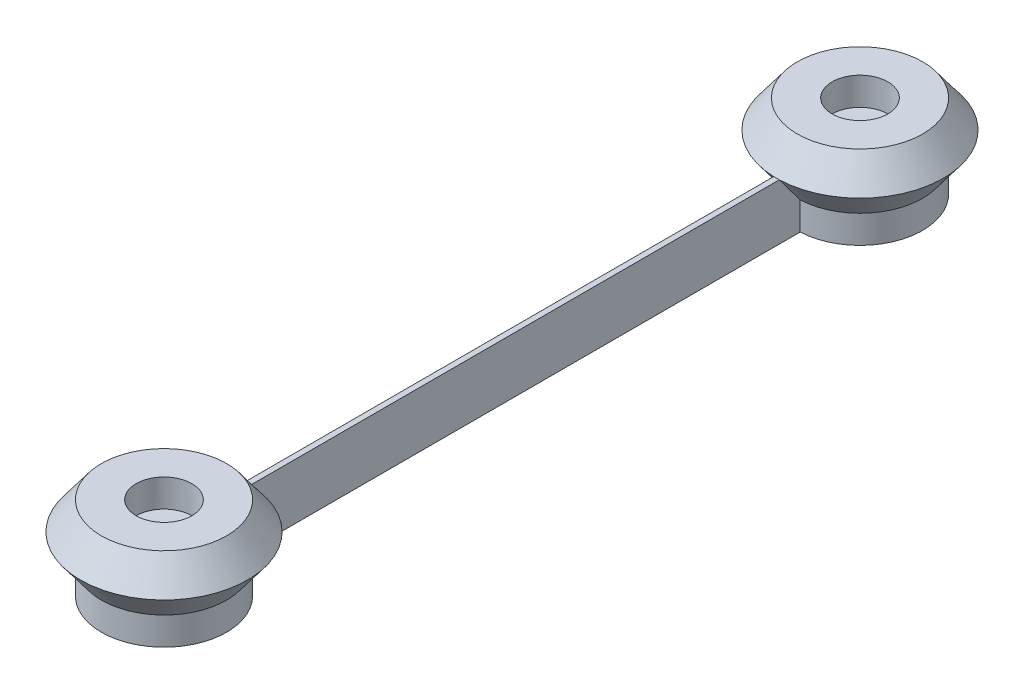
ISO-10303-21;
HEADER;
FILE_DESCRIPTION(('STEP AP214'),'2;1');
FILE_NAME('part.step','',(''),(''),'','','');
FILE_SCHEMA(('AUTOMOTIVE_DESIGN { 1 0 10303 214 1 1 1 1 }'));
ENDSEC;
DATA;
#1=APPLICATION_CONTEXT('core data for automotive mechanical design processes');
#2=APPLICATION_PROTOCOL_DEFINITION('international standard','automotive_design',2000,#1);
#3=PRODUCT_CONTEXT('',#1,'mechanical');
#4=PRODUCT('Part','Part','',(#3));
#5=PRODUCT_RELATED_PRODUCT_CATEGORY('part','',(#4));
#6=PRODUCT_DEFINITION_FORMATION('','',#4);
#7=PRODUCT_DEFINITION_CONTEXT('part definition',#1,'design');
#8=PRODUCT_DEFINITION('design','',#6,#7);
#9=PRODUCT_DEFINITION_SHAPE('','',#8);
#10=(LENGTH_UNIT() NAMED_UNIT(*) SI_UNIT(.MILLI.,.METRE.));
#11=(NAMED_UNIT(*) PLANE_ANGLE_UNIT() SI_UNIT($,.RADIAN.));
#12=(NAMED_UNIT(*) SI_UNIT($,.STERADIAN.) SOLID_ANGLE_UNIT());
#13=UNCERTAINTY_MEASURE_WITH_UNIT(LENGTH_MEASURE(1.E-05),#10,'distance_accuracy_value','');
#14=(GEOMETRIC_REPRESENTATION_CONTEXT(3) GLOBAL_UNCERTAINTY_ASSIGNED_CONTEXT((#13)) GLOBAL_UNIT_ASSIGNED_CONTEXT((#10,
#11,#12)) REPRESENTATION_CONTEXT('',''));
#15=CARTESIAN_POINT('',(0.,0.,0.));
#16=DIRECTION('',(0.,0.,1.));
#17=DIRECTION('',(1.,0.,0.));
#18=AXIS2_PLACEMENT_3D('',#15,#16,#17);
#19=CARTESIAN_POINT('',(0.400000000000017,8.,-4.00000000000001));
#20=DIRECTION('',(-1.,0.,0.));
#21=DIRECTION('',(0.,0.,1.));
#22=AXIS2_PLACEMENT_3D('',#19,#20,#21);
#23=PLANE('',#22);
#24=CARTESIAN_POINT('',(0.400000000000017,16.9444719099991,-81.29592272087));
#25=CARTESIAN_POINT('',(0.400000000000017,15.385579355443,-82.4653845755898));
#26=CARTESIAN_POINT('',(0.400000000000017,13.8266894406038,-83.6348499751761));
#27=CARTESIAN_POINT('',(0.400000000000017,10.7090037802558,-85.9739076348394));
#28=CARTESIAN_POINT('',(0.400000000000017,9.1502080347864,-87.1434998949687));
#29=CARTESIAN_POINT('',(0.400000000000017,6.81215641798637,-88.8980697267632));
#30=CARTESIAN_POINT('',(0.400000000000017,6.03283141406787,-89.4829551752583));
#31=CARTESIAN_POINT('',(0.400000000000017,4.47425913313125,-90.6528297579802));
#32=CARTESIAN_POINT('',(0.400000000000017,3.69501185611873,-91.2378188922144));
#33=CARTESIAN_POINT('',(0.400000000000017,2.13665772951559,-92.4079840697766));
#34=CARTESIAN_POINT('',(0.400000000000017,1.35755087991822,-92.9931601130956));
#35=CARTESIAN_POINT('',(0.400000000000017,-0.20039662916781,-94.1638664241077));
#36=CARTESIAN_POINT('',(0.400000000000017,-0.979237288697372,-94.7493966917463));
#37=CARTESIAN_POINT('',(0.400000000000017,-2.02365103499291,-95.5355919106607));
#38=CARTESIAN_POINT('',(0.400000000000017,-2.28954305826708,-95.7358330865061));
#39=CARTESIAN_POINT('',(0.400000000000017,-2.82119172556733,-96.1364947662393));
#40=CARTESIAN_POINT('',(0.400000000000017,-3.08694836967379,-96.3369152700204));
#41=CARTESIAN_POINT('',(0.400000000000017,-3.61824910011192,-96.738038761353));
#42=CARTESIAN_POINT('',(0.400000000000017,-3.88379318614195,-96.9387417493042));
#43=CARTESIAN_POINT('',(0.400000000000017,-4.28182573719319,-97.240171301074));
#44=CARTESIAN_POINT('',(0.400000000000017,-4.41445610822129,-97.3407104189299));
#45=CARTESIAN_POINT('',(0.400000000000017,-4.67957862864727,-97.5419709109763));
#46=CARTESIAN_POINT('',(0.400000000000017,-4.81207077794323,-97.6426922853009));
#47=CARTESIAN_POINT('',(0.400000000000017,-4.94447190999915,-97.7435333597211));
#48=B_SPLINE_CURVE_WITH_KNOTS('',3,(#24,#25,#26,#27,#28,#29,#30,#31,#32,#33,#34,#35,#36,#37,#38,
#39,#40,#41,#42,#43,#44,#45,#46,#47),.UNSPECIFIED.,.F.,.F.,(4,2,2,2,2,2,2,2,2,2,2,4),(0.,
5.84637353918376,11.6927495040903,14.6159234710631,17.5390976490765,20.4622716866267,
23.385445274793,24.3840221435363,25.3825984186201,26.381176108232,26.8804658349545,
27.3797559296049),.UNSPECIFIED.);
#49=CARTESIAN_POINT('',(0.400000000000017,8.,-88.006668519548));
#50=VERTEX_POINT('',#49);
#51=CARTESIAN_POINT('',(0.400000000000017,4.,-91.0088932828043));
#52=VERTEX_POINT('',#51);
#53=EDGE_CURVE('E111',#50,#52,#48,.T.);
#54=ORIENTED_EDGE('',*,*,#53,.F.);
#55=DIRECTION('',(0.,0.,-1.));
#56=VECTOR('',#55,1.);
#57=CARTESIAN_POINT('',(0.400000000000017,8.,-4.00000000000001));
#58=LINE('',#57,#56);
#59=CARTESIAN_POINT('',(0.400000000000017,8.,-11.993331480452));
#60=VERTEX_POINT('',#59);
#61=EDGE_CURVE('E99',#60,#50,#58,.T.);
#62=ORIENTED_EDGE('',*,*,#61,.F.);
#63=CARTESIAN_POINT('',(0.400000000000017,16.9444719099991,-18.7040772791299));
#64=CARTESIAN_POINT('',(0.400000000000017,15.3855793554431,-17.5346154244102));
#65=CARTESIAN_POINT('',(0.400000000000017,13.8266894406038,-16.3651500248238));
#66=CARTESIAN_POINT('',(0.400000000000017,10.7090037802558,-14.0260923651605));
#67=CARTESIAN_POINT('',(0.400000000000017,9.1502080347864,-12.8565001050312));
#68=CARTESIAN_POINT('',(0.400000000000017,6.81215641798636,-11.1019302732367));
#69=CARTESIAN_POINT('',(0.400000000000017,6.03283141406787,-10.5170448247416));
#70=CARTESIAN_POINT('',(0.400000000000017,4.47425913313124,-9.34717024201976));
#71=CARTESIAN_POINT('',(0.400000000000017,3.69501185611871,-8.76218110778552));
#72=CARTESIAN_POINT('',(0.400000000000017,2.13665772951557,-7.5920159302233));
#73=CARTESIAN_POINT('',(0.400000000000017,1.35755087991821,-7.0068398869043));
#74=CARTESIAN_POINT('',(0.400000000000017,-0.200396629167812,-5.8361335758922));
#75=CARTESIAN_POINT('',(0.400000000000017,-0.979237288697369,-5.25060330825358));
#76=CARTESIAN_POINT('',(0.400000000000017,-2.02365103499291,-4.46440808933921));
#77=CARTESIAN_POINT('',(0.400000000000017,-2.28954305826708,-4.26416691349383));
#78=CARTESIAN_POINT('',(0.400000000000017,-2.82119172556733,-3.86350523376065));
#79=CARTESIAN_POINT('',(0.400000000000017,-3.08694836967379,-3.66308472997953));
#80=CARTESIAN_POINT('',(0.400000000000017,-3.61824910011192,-3.26196123864695));
#81=CARTESIAN_POINT('',(0.400000000000017,-3.88379318614196,-3.06125825069575));
#82=CARTESIAN_POINT('',(0.400000000000017,-4.28182573719319,-2.75982869892592));
#83=CARTESIAN_POINT('',(0.400000000000017,-4.41445610822129,-2.65928958107001));
#84=CARTESIAN_POINT('',(0.400000000000017,-4.67957862864727,-2.45802908902366));
#85=CARTESIAN_POINT('',(0.400000000000017,-4.81207077794322,-2.35730771469898));
#86=CARTESIAN_POINT('',(0.400000000000017,-4.94447190999915,-2.2564666402788));
#87=B_SPLINE_CURVE_WITH_KNOTS('',3,(#63,#64,#65,#66,#67,#68,#69,#70,#71,#72,#73,#74,#75,#76,#77,
#78,#79,#80,#81,#82,#83,#84,#85,#86),.UNSPECIFIED.,.F.,.F.,(4,2,2,2,2,2,2,2,2,2,2,4),(0.,
5.84637353918377,11.6927495040903,14.6159234710631,17.5390976490765,20.4622716866267,
23.385445274793,24.3840221435363,25.3825984186201,26.381176108232,26.8804658349545,
27.3797559296049),.UNSPECIFIED.);
#88=CARTESIAN_POINT('',(0.400000000000017,4.,-8.99110671719561));
#89=VERTEX_POINT('',#88);
#90=EDGE_CURVE('E213',#60,#89,#87,.T.);
#91=ORIENTED_EDGE('',*,*,#90,.T.);
#92=DIRECTION('',(0.,1.,0.));
#93=VECTOR('',#92,1.);
#94=CARTESIAN_POINT('',(0.400000000000017,55.,-8.99110671719561));
#95=LINE('',#94,#93);
#96=CARTESIAN_POINT('',(0.400000000000017,0.,-8.99110671719561));
#97=VERTEX_POINT('',#96);
#98=EDGE_CURVE('E48',#89,#97,#95,.F.);
#99=ORIENTED_EDGE('',*,*,#98,.T.);
#100=DIRECTION('',(0.,0.,-1.));
#101=VECTOR('',#100,1.);
#102=CARTESIAN_POINT('',(0.400000000000017,0.,-4.00000000000001));
#103=LINE('',#102,#101);
#104=CARTESIAN_POINT('',(0.400000000000017,0.,-91.0088932828043));
#105=VERTEX_POINT('',#104);
#106=EDGE_CURVE('E60',#97,#105,#103,.T.);
#107=ORIENTED_EDGE('',*,*,#106,.T.);
#108=DIRECTION('',(0.,1.,0.));
#109=VECTOR('',#108,1.);
#110=CARTESIAN_POINT('',(0.400000000000017,55.,-91.0088932828043));
#111=LINE('',#110,#109);
#112=EDGE_CURVE('E55',#52,#105,#111,.F.);
#113=ORIENTED_EDGE('',*,*,#112,.F.);
#114=EDGE_LOOP('',(#54,#62,#91,#99,#107,#113));
#115=FACE_BOUND('',#114,.T.);
#116=ADVANCED_FACE('F39',(#115),#23,.F.);
#117=CARTESIAN_POINT('',(-0.399999999999994,8.,-4.00000000000001));
#118=DIRECTION('',(1.,0.,0.));
#119=DIRECTION('',(0.,0.,-1.));
#120=AXIS2_PLACEMENT_3D('',#117,#118,#119);
#121=PLANE('',#120);
#122=CARTESIAN_POINT('',(-0.400000000000017,-4.94447190999915,-97.7435333597211));
#123=CARTESIAN_POINT('',(-0.400000000000017,-4.75455753008875,-97.5989045674692));
#124=CARTESIAN_POINT('',(-0.400000000000017,-4.56446817401597,-97.4545061188517));
#125=CARTESIAN_POINT('',(-0.400000000000017,-4.18404163842859,-97.1660364882974));
#126=CARTESIAN_POINT('',(-0.400000000000017,-3.99370445924241,-97.0219653059276));
#127=CARTESIAN_POINT('',(-0.400000000000017,-3.42247425445222,-96.5900424307294));
#128=CARTESIAN_POINT('',(-0.400000000000017,-3.0413619329241,-96.3024809324298));
#129=CARTESIAN_POINT('',(-0.400000000000017,-2.27885694947998,-95.727734242676));
#130=CARTESIAN_POINT('',(-0.400000000000017,-1.89746428903754,-95.4405490492655));
#131=CARTESIAN_POINT('',(-0.400000000000017,-1.13451683232361,-94.8663940840555));
#132=CARTESIAN_POINT('',(-0.400000000000017,-0.752962036043189,-94.5794243122679));
#133=CARTESIAN_POINT('',(-0.400000000000016,0.391847218252152,-93.7187075803283));
#134=CARTESIAN_POINT('',(-0.400000000000016,1.15524648102529,-93.145153249297));
#135=CARTESIAN_POINT('',(-0.400000000000016,2.6822190242582,-91.9982713145222));
#136=CARTESIAN_POINT('',(-0.400000000000016,3.4457923052601,-91.4249437115005));
#137=CARTESIAN_POINT('',(-0.400000000000016,4.97303513422668,-90.2784169084195));
#138=CARTESIAN_POINT('',(-0.400000000000015,5.73670468218102,-89.7052177083463));
#139=CARTESIAN_POINT('',(-0.400000000000015,7.37065506466196,-88.4789256143192));
#140=CARTESIAN_POINT('',(-0.400000000000015,8.24094441755389,-87.8258440711942));
#141=CARTESIAN_POINT('',(-0.400000000000015,9.9815686479628,-86.5197415856132));
#142=CARTESIAN_POINT('',(-0.400000000000014,10.8519035254815,-85.8667206431594));
#143=CARTESIAN_POINT('',(-0.400000000000014,12.5925990134417,-84.5607213156453));
#144=CARTESIAN_POINT('',(-0.400000000000014,13.4629596237478,-83.9077429304047));
#145=CARTESIAN_POINT('',(-0.400000000000014,15.2037020085506,-82.6018144475124));
#146=CARTESIAN_POINT('',(-0.400000000000013,16.0740837830463,-81.9488643498595));
#147=CARTESIAN_POINT('',(-0.400000000000013,16.9444719099991,-81.29592272087));
#148=B_SPLINE_CURVE_WITH_KNOTS('',3,(#122,#123,#124,#125,#126,#127,#128,#129,#130,#131,#132,
#133,#134,#135,#136,#137,#138,#139,#140,#141,#142,#143,#144,#145,#146,#147),.UNSPECIFIED.,.F.,
.F.,(4,2,2,2,2,2,2,2,2,2,2,2,4),(0.,0.716145004176819,1.43228906029879,2.86457480435751,
4.29685307290087,5.72913142044231,8.59368834345143,11.458254316167,14.3228199817035,
17.587061320356,20.8513027851864,24.1155293809045,27.3797558383077),.UNSPECIFIED.);
#149=CARTESIAN_POINT('',(-0.400000000000016,4.,-91.0088932828043));
#150=VERTEX_POINT('',#149);
#151=CARTESIAN_POINT('',(-0.400000000000015,8.,-88.006668519548));
#152=VERTEX_POINT('',#151);
#153=EDGE_CURVE('E117',#150,#152,#148,.T.);
#154=ORIENTED_EDGE('',*,*,#153,.F.);
#155=DIRECTION('',(0.,1.,0.));
#156=VECTOR('',#155,1.);
#157=CARTESIAN_POINT('',(-0.400000000000016,55.,-91.0088932828043));
#158=LINE('',#157,#156);
#159=CARTESIAN_POINT('',(-0.400000000000016,0.,-91.0088932828043));
#160=VERTEX_POINT('',#159);
#161=EDGE_CURVE('E11',#160,#150,#158,.T.);
#162=ORIENTED_EDGE('',*,*,#161,.F.);
#163=DIRECTION('',(0.,0.,1.));
#164=VECTOR('',#163,1.);
#165=CARTESIAN_POINT('',(-0.399999999999994,0.,-4.00000000000001));
#166=LINE('',#165,#164);
#167=CARTESIAN_POINT('',(-0.399999999999995,0.,-8.99110671719561));
#168=VERTEX_POINT('',#167);
#169=EDGE_CURVE('E109',#160,#168,#166,.T.);
#170=ORIENTED_EDGE('',*,*,#169,.T.);
#171=DIRECTION('',(0.,1.,0.));
#172=VECTOR('',#171,1.);
#173=CARTESIAN_POINT('',(-0.399999999999996,55.,-8.99110671719561));
#174=LINE('',#173,#172);
#175=CARTESIAN_POINT('',(-0.399999999999995,4.,-8.99110671719561));
#176=VERTEX_POINT('',#175);
#177=EDGE_CURVE('E263',#168,#176,#174,.T.);
#178=ORIENTED_EDGE('',*,*,#177,.T.);
#179=CARTESIAN_POINT('',(-0.399999999999994,-4.94447190999915,-2.2564666402788));
#180=CARTESIAN_POINT('',(-0.399999999999994,-4.75455753008875,-2.40109543253071));
#181=CARTESIAN_POINT('',(-0.399999999999994,-4.56446817401597,-2.54549388114825));
#182=CARTESIAN_POINT('',(-0.399999999999994,-4.1840416384286,-2.83396351170257));
#183=CARTESIAN_POINT('',(-0.399999999999994,-3.99370445924242,-2.97803469407232));
#184=CARTESIAN_POINT('',(-0.399999999999994,-3.42247425445222,-3.4099575692705));
#185=CARTESIAN_POINT('',(-0.399999999999994,-3.0413619329241,-3.69751906757008));
#186=CARTESIAN_POINT('',(-0.399999999999994,-2.27885694947999,-4.27226575732393));
#187=CARTESIAN_POINT('',(-0.399999999999994,-1.89746428903755,-4.55945095073442));
#188=CARTESIAN_POINT('',(-0.399999999999995,-1.13451683232363,-5.13360591594438));
#189=CARTESIAN_POINT('',(-0.399999999999995,-0.752962036043208,-5.42057568773197));
#190=CARTESIAN_POINT('',(-0.399999999999995,0.391847218252136,-6.28129241967163));
#191=CARTESIAN_POINT('',(-0.399999999999995,1.15524648102528,-6.85484675070287));
#192=CARTESIAN_POINT('',(-0.399999999999995,2.68221902425818,-8.00172868547775));
#193=CARTESIAN_POINT('',(-0.399999999999995,3.44579230526008,-8.5750562884994));
#194=CARTESIAN_POINT('',(-0.399999999999996,4.97303513422666,-9.72158309158042));
#195=CARTESIAN_POINT('',(-0.399999999999996,5.736704682181,-10.2947822916536));
#196=CARTESIAN_POINT('',(-0.399999999999996,7.37065506466194,-11.5210743856807));
#197=CARTESIAN_POINT('',(-0.399999999999996,8.24094441755387,-12.1741559288057));
#198=CARTESIAN_POINT('',(-0.399999999999997,9.98156864796278,-13.4802584143867));
#199=CARTESIAN_POINT('',(-0.399999999999997,10.8519035254815,-14.1332793568405));
#200=CARTESIAN_POINT('',(-0.399999999999997,12.5925990134417,-15.4392786843546));
#201=CARTESIAN_POINT('',(-0.399999999999997,13.4629596237478,-16.0922570695952));
#202=CARTESIAN_POINT('',(-0.399999999999998,15.2037020085506,-17.3981855524875));
#203=CARTESIAN_POINT('',(-0.399999999999998,16.0740837830463,-18.0511356501404));
#204=CARTESIAN_POINT('',(-0.399999999999998,16.9444719099991,-18.7040772791299));
#205=B_SPLINE_CURVE_WITH_KNOTS('',3,(#179,#180,#181,#182,#183,#184,#185,#186,#187,#188,#189,
#190,#191,#192,#193,#194,#195,#196,#197,#198,#199,#200,#201,#202,#203,#204),.UNSPECIFIED.,.F.,
.F.,(4,2,2,2,2,2,2,2,2,2,2,2,4),(0.,0.716145004176819,1.43228906029878,2.8645748043575,
4.29685307290085,5.72913142044229,8.59368834345142,11.458254316167,14.3228199817035,
17.587061320356,20.8513027851864,24.1155293809045,27.3797558383077),.UNSPECIFIED.);
#206=CARTESIAN_POINT('',(-0.399999999999996,8.,-11.993331480452));
#207=VERTEX_POINT('',#206);
#208=EDGE_CURVE('E222',#176,#207,#205,.T.);
#209=ORIENTED_EDGE('',*,*,#208,.T.);
#210=DIRECTION('',(0.,0.,1.));
#211=VECTOR('',#210,1.);
#212=CARTESIAN_POINT('',(-0.399999999999994,8.,-4.00000000000001));
#213=LINE('',#212,#211);
#214=EDGE_CURVE('E108',#152,#207,#213,.T.);
#215=ORIENTED_EDGE('',*,*,#214,.F.);
#216=EDGE_LOOP('',(#154,#162,#170,#178,#209,#215));
#217=FACE_BOUND('',#216,.T.);
#218=ADVANCED_FACE('F164',(#217),#121,.F.);
#219=CARTESIAN_POINT('',(0.,4.,0.));
#220=DIRECTION('',(0.,1.,0.));
#221=DIRECTION('',(0.,0.,1.));
#222=AXIS2_PLACEMENT_3D('',#219,#220,#221);
#223=CONICAL_SURFACE('',#222,9.,0.643501108793285);
#224=ORIENTED_EDGE('',*,*,#90,.F.);
#225=CARTESIAN_POINT('',(0.,8.,0.));
#226=DIRECTION('',(0.,1.,0.));
#227=DIRECTION('',(0.,0.,1.));
#228=AXIS2_PLACEMENT_3D('',#225,#226,#227);
#229=CIRCLE('',#228,12.);
#230=EDGE_CURVE('E293',#207,#60,#229,.T.);
#231=ORIENTED_EDGE('',*,*,#230,.F.);
#232=ORIENTED_EDGE('',*,*,#208,.F.);
#233=CARTESIAN_POINT('',(0.,4.,0.));
#234=DIRECTION('',(0.,1.,0.));
#235=DIRECTION('',(0.,0.,1.));
#236=AXIS2_PLACEMENT_3D('',#233,#234,#235);
#237=CIRCLE('',#236,9.);
#238=EDGE_CURVE('E291',#176,#89,#237,.T.);
#239=ORIENTED_EDGE('',*,*,#238,.T.);
#240=EDGE_LOOP('',(#224,#231,#232,#239));
#241=FACE_BOUND('',#240,.T.);
#242=ADVANCED_FACE('F205',(#241),#223,.T.);
#243=CARTESIAN_POINT('',(0.,55.,0.));
#244=DIRECTION('',(0.,1.,0.));
#245=DIRECTION('',(0.,0.,1.));
#246=AXIS2_PLACEMENT_3D('',#243,#244,#245);
#247=CYLINDRICAL_SURFACE('',#246,9.);
#248=ORIENTED_EDGE('',*,*,#98,.F.);
#249=ORIENTED_EDGE('',*,*,#238,.F.);
#250=ORIENTED_EDGE('',*,*,#177,.F.);
#251=CARTESIAN_POINT('',(0.,0.,0.));
#252=DIRECTION('',(0.,1.,0.));
#253=DIRECTION('',(0.,0.,1.));
#254=AXIS2_PLACEMENT_3D('',#251,#252,#253);
#255=CIRCLE('',#254,9.00000000000001);
#256=EDGE_CURVE('E221',#168,#97,#255,.T.);
#257=ORIENTED_EDGE('',*,*,#256,.T.);
#258=EDGE_LOOP('',(#248,#249,#250,#257));
#259=FACE_BOUND('',#258,.T.);
#260=ADVANCED_FACE('F209',(#259),#247,.T.);
#261=CARTESIAN_POINT('',(0.,0.,-9.00000000000001));
#262=DIRECTION('',(0.,1.,0.));
#263=DIRECTION('',(0.,0.,1.));
#264=AXIS2_PLACEMENT_3D('',#261,#262,#263);
#265=PLANE('',#264);
#266=ORIENTED_EDGE('',*,*,#169,.F.);
#267=CARTESIAN_POINT('',(0.,0.,-99.9999999999999));
#268=DIRECTION('',(0.,-1.,0.));
#269=DIRECTION('',(0.,0.,-1.));
#270=AXIS2_PLACEMENT_3D('',#267,#268,#269);
#271=CIRCLE('',#270,9.00000000000001);
#272=EDGE_CURVE('E281',#160,#105,#271,.T.);
#273=ORIENTED_EDGE('',*,*,#272,.T.);
#274=ORIENTED_EDGE('',*,*,#106,.F.);
#275=ORIENTED_EDGE('',*,*,#256,.F.);
#276=EDGE_LOOP('',(#266,#273,#274,#275));
#277=FACE_BOUND('',#276,.T.);
#278=CARTESIAN_POINT('',(0.,0.,0.));
#279=DIRECTION('',(0.,1.,0.));
#280=DIRECTION('',(0.,0.,1.));
#281=AXIS2_PLACEMENT_3D('',#278,#279,#280);
#282=CIRCLE('',#281,1.5);
#283=CARTESIAN_POINT('',(0.,0.,1.5));
#284=VERTEX_POINT('',#283);
#285=EDGE_CURVE('E254',#284,#284,#282,.T.);
#286=ORIENTED_EDGE('',*,*,#285,.T.);
#287=EDGE_LOOP('',(#286));
#288=FACE_BOUND('',#287,.T.);
#289=CARTESIAN_POINT('',(0.,0.,-99.9999999999999));
#290=DIRECTION('',(0.,-1.,0.));
#291=DIRECTION('',(0.,0.,-1.));
#292=AXIS2_PLACEMENT_3D('',#289,#290,#291);
#293=CIRCLE('',#292,1.5);
#294=CARTESIAN_POINT('',(0.,0.,-101.5));
#295=VERTEX_POINT('',#294);
#296=EDGE_CURVE('E147',#295,#295,#293,.T.);
#297=ORIENTED_EDGE('',*,*,#296,.F.);
#298=EDGE_LOOP('',(#297));
#299=FACE_BOUND('',#298,.T.);
#300=ADVANCED_FACE('F41',(#277,#288,#299),#265,.F.);
#301=CARTESIAN_POINT('',(0.,55.,0.));
#302=DIRECTION('',(0.,1.,0.));
#303=DIRECTION('',(0.,0.,1.));
#304=AXIS2_PLACEMENT_3D('',#301,#302,#303);
#305=CYLINDRICAL_SURFACE('',#304,1.5);
#306=ORIENTED_EDGE('',*,*,#285,.F.);
#307=EDGE_LOOP('',(#306));
#308=FACE_BOUND('',#307,.T.);
#309=CARTESIAN_POINT('',(0.,8.,0.));
#310=DIRECTION('',(0.,1.,0.));
#311=DIRECTION('',(0.,0.,1.));
#312=AXIS2_PLACEMENT_3D('',#309,#310,#311);
#313=CIRCLE('',#312,1.5);
#314=CARTESIAN_POINT('',(0.,8.,1.5));
#315=VERTEX_POINT('',#314);
#316=EDGE_CURVE('E257',#315,#315,#313,.T.);
#317=ORIENTED_EDGE('',*,*,#316,.T.);
#318=EDGE_LOOP('',(#317));
#319=FACE_BOUND('',#318,.T.);
#320=ADVANCED_FACE('F243',(#308,#319),#305,.F.);
#321=CARTESIAN_POINT('',(0.,8.,-1.5));
#322=DIRECTION('',(0.,-1.,0.));
#323=DIRECTION('',(0.,0.,-1.));
#324=AXIS2_PLACEMENT_3D('',#321,#322,#323);
#325=PLANE('',#324);
#326=ORIENTED_EDGE('',*,*,#316,.F.);
#327=EDGE_LOOP('',(#326));
#328=FACE_BOUND('',#327,.T.);
#329=CARTESIAN_POINT('',(0.,8.,0.));
#330=DIRECTION('',(0.,1.,0.));
#331=DIRECTION('',(0.,0.,1.));
#332=AXIS2_PLACEMENT_3D('',#329,#330,#331);
#333=CIRCLE('',#332,4.);
#334=CARTESIAN_POINT('',(0.,8.,-4.));
#335=VERTEX_POINT('',#334);
#336=EDGE_CURVE('E259',#335,#335,#333,.T.);
#337=ORIENTED_EDGE('',*,*,#336,.T.);
#338=EDGE_LOOP('',(#337));
#339=FACE_BOUND('',#338,.T.);
#340=ADVANCED_FACE('F240',(#328,#339),#325,.F.);
#341=CARTESIAN_POINT('',(0.,55.,0.));
#342=DIRECTION('',(0.,1.,0.));
#343=DIRECTION('',(0.,0.,1.));
#344=AXIS2_PLACEMENT_3D('',#341,#342,#343);
#345=CYLINDRICAL_SURFACE('',#344,4.);
#346=ORIENTED_EDGE('',*,*,#336,.F.);
#347=EDGE_LOOP('',(#346));
#348=FACE_BOUND('',#347,.T.);
#349=CARTESIAN_POINT('',(0.,12.,0.));
#350=DIRECTION('',(0.,1.,0.));
#351=DIRECTION('',(0.,0.,1.));
#352=AXIS2_PLACEMENT_3D('',#349,#350,#351);
#353=CIRCLE('',#352,4.);
#354=CARTESIAN_POINT('',(0.,12.,4.));
#355=VERTEX_POINT('',#354);
#356=EDGE_CURVE('E265',#355,#355,#353,.T.);
#357=ORIENTED_EDGE('',*,*,#356,.T.);
#358=EDGE_LOOP('',(#357));
#359=FACE_BOUND('',#358,.T.);
#360=ADVANCED_FACE('F236',(#348,#359),#345,.F.);
#361=CARTESIAN_POINT('',(0.,12.,-4.));
#362=DIRECTION('',(0.,-1.,0.));
#363=DIRECTION('',(0.,0.,-1.));
#364=AXIS2_PLACEMENT_3D('',#361,#362,#363);
#365=PLANE('',#364);
#366=ORIENTED_EDGE('',*,*,#356,.F.);
#367=EDGE_LOOP('',(#366));
#368=FACE_BOUND('',#367,.T.);
#369=CARTESIAN_POINT('',(0.,12.,0.));
#370=DIRECTION('',(0.,1.,0.));
#371=DIRECTION('',(0.,0.,1.));
#372=AXIS2_PLACEMENT_3D('',#369,#370,#371);
#373=CIRCLE('',#372,9.00000000000001);
#374=CARTESIAN_POINT('',(0.,12.,9.00000000000001));
#375=VERTEX_POINT('',#374);
#376=EDGE_CURVE('E300',#375,#375,#373,.T.);
#377=ORIENTED_EDGE('',*,*,#376,.T.);
#378=EDGE_LOOP('',(#377));
#379=FACE_BOUND('',#378,.T.);
#380=ADVANCED_FACE('F198',(#368,#379),#365,.F.);
#381=CARTESIAN_POINT('',(0.,8.,0.));
#382=DIRECTION('',(0.,-1.,0.));
#383=DIRECTION('',(0.,0.,-1.));
#384=AXIS2_PLACEMENT_3D('',#381,#382,#383);
#385=CONICAL_SURFACE('',#384,12.,0.643501108793284);
#386=ORIENTED_EDGE('',*,*,#376,.F.);
#387=EDGE_LOOP('',(#386));
#388=FACE_BOUND('',#387,.T.);
#389=EDGE_CURVE('E105',#60,#207,#229,.T.);
#390=ORIENTED_EDGE('',*,*,#389,.T.);
#391=ORIENTED_EDGE('',*,*,#230,.T.);
#392=EDGE_LOOP('',(#390,#391));
#393=FACE_BOUND('',#392,.T.);
#394=ADVANCED_FACE('F192',(#388,#393),#385,.T.);
#395=CARTESIAN_POINT('',(0.,8.,0.));
#396=DIRECTION('',(0.,-1.,0.));
#397=DIRECTION('',(0.,0.,-1.));
#398=AXIS2_PLACEMENT_3D('',#395,#396,#397);
#399=PLANE('',#398);
#400=CARTESIAN_POINT('',(0.,8.,-99.9999999999999));
#401=DIRECTION('',(0.,-1.,0.));
#402=DIRECTION('',(0.,0.,-1.));
#403=AXIS2_PLACEMENT_3D('',#400,#401,#402);
#404=CIRCLE('',#403,12.);
#405=EDGE_CURVE('E102',#50,#152,#404,.T.);
#406=ORIENTED_EDGE('',*,*,#405,.T.);
#407=ORIENTED_EDGE('',*,*,#214,.T.);
#408=ORIENTED_EDGE('',*,*,#389,.F.);
#409=ORIENTED_EDGE('',*,*,#61,.T.);
#410=EDGE_LOOP('',(#406,#407,#408,#409));
#411=FACE_BOUND('',#410,.T.);
#412=ADVANCED_FACE('F100',(#411),#399,.F.);
#413=CARTESIAN_POINT('',(0.,55.,-99.9999999999999));
#414=DIRECTION('',(0.,1.,0.));
#415=DIRECTION('',(0.,0.,-1.));
#416=AXIS2_PLACEMENT_3D('',#413,#414,#415);
#417=CYLINDRICAL_SURFACE('',#416,9.);
#418=CARTESIAN_POINT('',(0.,4.,-99.9999999999999));
#419=DIRECTION('',(0.,-1.,0.));
#420=DIRECTION('',(0.,0.,-1.));
#421=AXIS2_PLACEMENT_3D('',#418,#419,#420);
#422=CIRCLE('',#421,9.);
#423=EDGE_CURVE('E125',#150,#52,#422,.T.);
#424=ORIENTED_EDGE('',*,*,#423,.T.);
#425=ORIENTED_EDGE('',*,*,#112,.T.);
#426=ORIENTED_EDGE('',*,*,#272,.F.);
#427=ORIENTED_EDGE('',*,*,#161,.T.);
#428=EDGE_LOOP('',(#424,#425,#426,#427));
#429=FACE_BOUND('',#428,.T.);
#430=ADVANCED_FACE('F172',(#429),#417,.T.);
#431=CARTESIAN_POINT('',(0.,4.,-99.9999999999999));
#432=DIRECTION('',(0.,1.,0.));
#433=DIRECTION('',(0.,0.,-1.));
#434=AXIS2_PLACEMENT_3D('',#431,#432,#433);
#435=CONICAL_SURFACE('',#434,9.,0.643501108793285);
#436=EDGE_CURVE('E121',#152,#50,#404,.T.);
#437=ORIENTED_EDGE('',*,*,#436,.T.);
#438=ORIENTED_EDGE('',*,*,#53,.T.);
#439=ORIENTED_EDGE('',*,*,#423,.F.);
#440=ORIENTED_EDGE('',*,*,#153,.T.);
#441=EDGE_LOOP('',(#437,#438,#439,#440));
#442=FACE_BOUND('',#441,.T.);
#443=ADVANCED_FACE('F122',(#442),#435,.T.);
#444=CARTESIAN_POINT('',(0.,55.,-99.9999999999999));
#445=DIRECTION('',(0.,1.,0.));
#446=DIRECTION('',(0.,0.,-1.));
#447=AXIS2_PLACEMENT_3D('',#444,#445,#446);
#448=CYLINDRICAL_SURFACE('',#447,1.5);
#449=ORIENTED_EDGE('',*,*,#296,.T.);
#450=EDGE_LOOP('',(#449));
#451=FACE_BOUND('',#450,.T.);
#452=CARTESIAN_POINT('',(0.,8.,-99.9999999999999));
#453=DIRECTION('',(0.,-1.,0.));
#454=DIRECTION('',(0.,0.,-1.));
#455=AXIS2_PLACEMENT_3D('',#452,#453,#454);
#456=CIRCLE('',#455,1.5);
#457=CARTESIAN_POINT('',(0.,8.,-101.5));
#458=VERTEX_POINT('',#457);
#459=EDGE_CURVE('E143',#458,#458,#456,.T.);
#460=ORIENTED_EDGE('',*,*,#459,.F.);
#461=EDGE_LOOP('',(#460));
#462=FACE_BOUND('',#461,.T.);
#463=ADVANCED_FACE('F171',(#451,#462),#448,.F.);
#464=CARTESIAN_POINT('',(0.,8.,-98.4999999999999));
#465=DIRECTION('',(0.,-1.,0.));
#466=DIRECTION('',(0.,0.,1.));
#467=AXIS2_PLACEMENT_3D('',#464,#465,#466);
#468=PLANE('',#467);
#469=ORIENTED_EDGE('',*,*,#459,.T.);
#470=EDGE_LOOP('',(#469));
#471=FACE_BOUND('',#470,.T.);
#472=CARTESIAN_POINT('',(0.,8.,-99.9999999999999));
#473=DIRECTION('',(0.,-1.,0.));
#474=DIRECTION('',(0.,0.,-1.));
#475=AXIS2_PLACEMENT_3D('',#472,#473,#474);
#476=CIRCLE('',#475,4.);
#477=CARTESIAN_POINT('',(0.,8.,-95.9999999999999));
#478=VERTEX_POINT('',#477);
#479=EDGE_CURVE('E140',#478,#478,#476,.T.);
#480=ORIENTED_EDGE('',*,*,#479,.F.);
#481=EDGE_LOOP('',(#480));
#482=FACE_BOUND('',#481,.T.);
#483=ADVANCED_FACE('F184',(#471,#482),#468,.F.);
#484=CARTESIAN_POINT('',(0.,55.,-99.9999999999999));
#485=DIRECTION('',(0.,1.,0.));
#486=DIRECTION('',(0.,0.,-1.));
#487=AXIS2_PLACEMENT_3D('',#484,#485,#486);
#488=CYLINDRICAL_SURFACE('',#487,4.);
#489=ORIENTED_EDGE('',*,*,#479,.T.);
#490=EDGE_LOOP('',(#489));
#491=FACE_BOUND('',#490,.T.);
#492=CARTESIAN_POINT('',(0.,12.,-99.9999999999999));
#493=DIRECTION('',(0.,-1.,0.));
#494=DIRECTION('',(0.,0.,-1.));
#495=AXIS2_PLACEMENT_3D('',#492,#493,#494);
#496=CIRCLE('',#495,4.);
#497=CARTESIAN_POINT('',(0.,12.,-104.));
#498=VERTEX_POINT('',#497);
#499=EDGE_CURVE('E132',#498,#498,#496,.T.);
#500=ORIENTED_EDGE('',*,*,#499,.F.);
#501=EDGE_LOOP('',(#500));
#502=FACE_BOUND('',#501,.T.);
#503=ADVANCED_FACE('F180',(#491,#502),#488,.F.);
#504=CARTESIAN_POINT('',(0.,12.,-95.9999999999999));
#505=DIRECTION('',(0.,-1.,0.));
#506=DIRECTION('',(0.,0.,1.));
#507=AXIS2_PLACEMENT_3D('',#504,#505,#506);
#508=PLANE('',#507);
#509=ORIENTED_EDGE('',*,*,#499,.T.);
#510=EDGE_LOOP('',(#509));
#511=FACE_BOUND('',#510,.T.);
#512=CARTESIAN_POINT('',(0.,12.,-99.9999999999999));
#513=DIRECTION('',(0.,-1.,0.));
#514=DIRECTION('',(0.,0.,-1.));
#515=AXIS2_PLACEMENT_3D('',#512,#513,#514);
#516=CIRCLE('',#515,9.00000000000001);
#517=CARTESIAN_POINT('',(0.,12.,-109.));
#518=VERTEX_POINT('',#517);
#519=EDGE_CURVE('E129',#518,#518,#516,.T.);
#520=ORIENTED_EDGE('',*,*,#519,.F.);
#521=EDGE_LOOP('',(#520));
#522=FACE_BOUND('',#521,.T.);
#523=ADVANCED_FACE('F176',(#511,#522),#508,.F.);
#524=CARTESIAN_POINT('',(0.,8.,-99.9999999999999));
#525=DIRECTION('',(0.,-1.,0.));
#526=DIRECTION('',(0.,0.,1.));
#527=AXIS2_PLACEMENT_3D('',#524,#525,#526);
#528=CONICAL_SURFACE('',#527,12.,0.643501108793284);
#529=ORIENTED_EDGE('',*,*,#519,.T.);
#530=EDGE_LOOP('',(#529));
#531=FACE_BOUND('',#530,.T.);
#532=ORIENTED_EDGE('',*,*,#405,.F.);
#533=ORIENTED_EDGE('',*,*,#436,.F.);
#534=EDGE_LOOP('',(#532,#533));
#535=FACE_BOUND('',#534,.T.);
#536=ADVANCED_FACE('F127',(#531,#535),#528,.T.);
#537=CLOSED_SHELL('',(#116,#218,#242,#260,#300,#320,#340,#360,#380,#394,#412,#430,#443,#463,
#483,#503,#523,#536));
#538=MANIFOLD_SOLID_BREP('B2',#537);
#539=ADVANCED_BREP_SHAPE_REPRESENTATION('',(#18,#538),#14);
#540=SHAPE_DEFINITION_REPRESENTATION(#9,#539);
ENDSEC;
END-ISO-10303-21;
